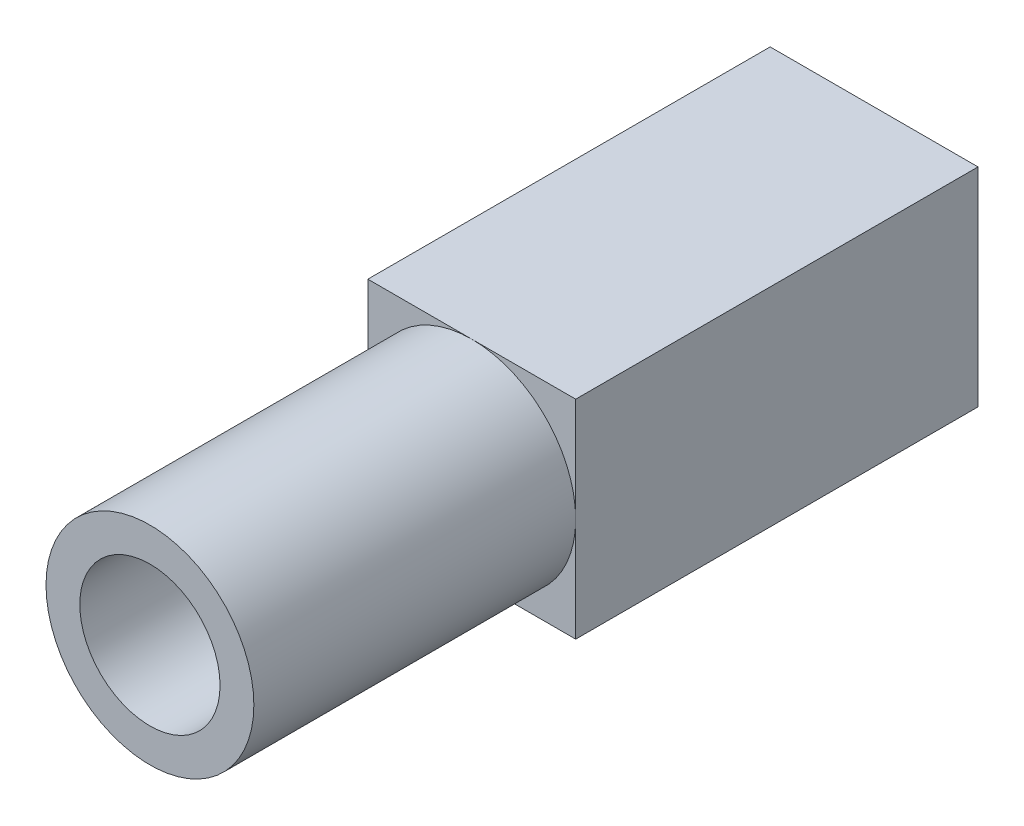
ISO-10303-21;
HEADER;
FILE_DESCRIPTION(('STEP AP214'),'2;1');
FILE_NAME('part.step','',(''),(''),'','','');
FILE_SCHEMA(('AUTOMOTIVE_DESIGN { 1 0 10303 214 1 1 1 1 }'));
ENDSEC;
DATA;
#1=APPLICATION_CONTEXT('core data for automotive mechanical design processes');
#2=APPLICATION_PROTOCOL_DEFINITION('international standard','automotive_design',2000,#1);
#3=PRODUCT_CONTEXT('',#1,'mechanical');
#4=PRODUCT('Part','Part','',(#3));
#5=PRODUCT_RELATED_PRODUCT_CATEGORY('part','',(#4));
#6=PRODUCT_DEFINITION_FORMATION('','',#4);
#7=PRODUCT_DEFINITION_CONTEXT('part definition',#1,'design');
#8=PRODUCT_DEFINITION('design','',#6,#7);
#9=PRODUCT_DEFINITION_SHAPE('','',#8);
#10=(LENGTH_UNIT() NAMED_UNIT(*) SI_UNIT(.MILLI.,.METRE.));
#11=(NAMED_UNIT(*) PLANE_ANGLE_UNIT() SI_UNIT($,.RADIAN.));
#12=(NAMED_UNIT(*) SI_UNIT($,.STERADIAN.) SOLID_ANGLE_UNIT());
#13=UNCERTAINTY_MEASURE_WITH_UNIT(LENGTH_MEASURE(1.E-05),#10,'distance_accuracy_value','');
#14=(GEOMETRIC_REPRESENTATION_CONTEXT(3) GLOBAL_UNCERTAINTY_ASSIGNED_CONTEXT((#13)) GLOBAL_UNIT_ASSIGNED_CONTEXT((#10,
#11,#12)) REPRESENTATION_CONTEXT('',''));
#15=CARTESIAN_POINT('',(0.,0.,0.));
#16=DIRECTION('',(0.,0.,1.));
#17=DIRECTION('',(1.,0.,0.));
#18=AXIS2_PLACEMENT_3D('',#15,#16,#17);
#19=CARTESIAN_POINT('',(0.,0.,22.));
#20=DIRECTION('',(0.,0.,-1.));
#21=DIRECTION('',(-1.,0.,0.));
#22=AXIS2_PLACEMENT_3D('',#19,#20,#21);
#23=CYLINDRICAL_SURFACE('',#22,3.875);
#24=CARTESIAN_POINT('',(0.,0.,22.));
#25=DIRECTION('',(0.,0.,1.));
#26=DIRECTION('',(1.,0.,0.));
#27=AXIS2_PLACEMENT_3D('',#24,#25,#26);
#28=CIRCLE('',#27,3.875);
#29=CARTESIAN_POINT('',(3.875,0.,22.));
#30=VERTEX_POINT('',#29);
#31=EDGE_CURVE('E12',#30,#30,#28,.T.);
#32=ORIENTED_EDGE('',*,*,#31,.F.);
#33=EDGE_LOOP('',(#32));
#34=FACE_BOUND('',#33,.T.);
#35=CARTESIAN_POINT('',(0.,0.,10.));
#36=DIRECTION('',(0.,0.,1.));
#37=DIRECTION('',(1.,0.,0.));
#38=AXIS2_PLACEMENT_3D('',#35,#36,#37);
#39=CIRCLE('',#38,3.875);
#40=CARTESIAN_POINT('',(-3.875,0.,10.));
#41=VERTEX_POINT('',#40);
#42=CARTESIAN_POINT('',(0.,-3.875,10.));
#43=VERTEX_POINT('',#42);
#44=EDGE_CURVE('E176',#41,#43,#39,.T.);
#45=ORIENTED_EDGE('',*,*,#44,.T.);
#46=CARTESIAN_POINT('',(0.,0.,10.));
#47=DIRECTION('',(0.,0.,1.));
#48=DIRECTION('',(1.,0.,0.));
#49=AXIS2_PLACEMENT_3D('',#46,#47,#48);
#50=CIRCLE('',#49,3.875);
#51=CARTESIAN_POINT('',(3.875,0.,10.));
#52=VERTEX_POINT('',#51);
#53=EDGE_CURVE('E163',#43,#52,#50,.T.);
#54=ORIENTED_EDGE('',*,*,#53,.T.);
#55=CARTESIAN_POINT('',(0.,0.,10.));
#56=DIRECTION('',(0.,0.,1.));
#57=DIRECTION('',(1.,0.,0.));
#58=AXIS2_PLACEMENT_3D('',#55,#56,#57);
#59=CIRCLE('',#58,3.875);
#60=CARTESIAN_POINT('',(0.,3.875,10.));
#61=VERTEX_POINT('',#60);
#62=EDGE_CURVE('E172',#52,#61,#59,.T.);
#63=ORIENTED_EDGE('',*,*,#62,.T.);
#64=CARTESIAN_POINT('',(0.,0.,10.));
#65=DIRECTION('',(0.,0.,1.));
#66=DIRECTION('',(1.,0.,0.));
#67=AXIS2_PLACEMENT_3D('',#64,#65,#66);
#68=CIRCLE('',#67,3.875);
#69=EDGE_CURVE('E181',#61,#41,#68,.T.);
#70=ORIENTED_EDGE('',*,*,#69,.T.);
#71=EDGE_LOOP('',(#45,#54,#63,#70));
#72=FACE_BOUND('',#71,.T.);
#73=ADVANCED_FACE('F80',(#34,#72),#23,.T.);
#74=CARTESIAN_POINT('',(0.,0.,22.));
#75=DIRECTION('',(0.,0.,1.));
#76=DIRECTION('',(1.,0.,0.));
#77=AXIS2_PLACEMENT_3D('',#74,#75,#76);
#78=PLANE('',#77);
#79=ORIENTED_EDGE('',*,*,#31,.T.);
#80=EDGE_LOOP('',(#79));
#81=FACE_BOUND('',#80,.T.);
#82=CARTESIAN_POINT('',(0.,0.,22.));
#83=DIRECTION('',(0.,0.,1.));
#84=DIRECTION('',(1.,0.,0.));
#85=AXIS2_PLACEMENT_3D('',#82,#83,#84);
#86=CIRCLE('',#85,2.615);
#87=CARTESIAN_POINT('',(2.615,0.,22.));
#88=VERTEX_POINT('',#87);
#89=EDGE_CURVE('E87',#88,#88,#86,.T.);
#90=ORIENTED_EDGE('',*,*,#89,.F.);
#91=EDGE_LOOP('',(#90));
#92=FACE_BOUND('',#91,.T.);
#93=ADVANCED_FACE('F203',(#81,#92),#78,.T.);
#94=CARTESIAN_POINT('',(0.,0.,22.));
#95=DIRECTION('',(0.,0.,-1.));
#96=DIRECTION('',(-1.,0.,0.));
#97=AXIS2_PLACEMENT_3D('',#94,#95,#96);
#98=CYLINDRICAL_SURFACE('',#97,2.615);
#99=ORIENTED_EDGE('',*,*,#89,.T.);
#100=EDGE_LOOP('',(#99));
#101=FACE_BOUND('',#100,.T.);
#102=CARTESIAN_POINT('',(0.,0.,0.));
#103=DIRECTION('',(0.,0.,1.));
#104=DIRECTION('',(1.,0.,0.));
#105=AXIS2_PLACEMENT_3D('',#102,#103,#104);
#106=CIRCLE('',#105,2.615);
#107=CARTESIAN_POINT('',(2.615,0.,0.));
#108=VERTEX_POINT('',#107);
#109=EDGE_CURVE('E193',#108,#108,#106,.T.);
#110=ORIENTED_EDGE('',*,*,#109,.F.);
#111=EDGE_LOOP('',(#110));
#112=FACE_BOUND('',#111,.T.);
#113=ADVANCED_FACE('F200',(#101,#112),#98,.F.);
#114=CARTESIAN_POINT('',(0.,0.,10.));
#115=DIRECTION('',(0.,0.,1.));
#116=DIRECTION('',(1.,0.,0.));
#117=AXIS2_PLACEMENT_3D('',#114,#115,#116);
#118=PLANE('',#117);
#119=ORIENTED_EDGE('',*,*,#69,.F.);
#120=DIRECTION('',(1.,0.,0.));
#121=VECTOR('',#120,1.);
#122=CARTESIAN_POINT('',(0.,3.875,10.));
#123=LINE('',#122,#121);
#124=CARTESIAN_POINT('',(-3.875,3.875,10.));
#125=VERTEX_POINT('',#124);
#126=EDGE_CURVE('E187',#125,#61,#123,.T.);
#127=ORIENTED_EDGE('',*,*,#126,.F.);
#128=DIRECTION('',(0.,-1.,0.));
#129=VECTOR('',#128,1.);
#130=CARTESIAN_POINT('',(-3.875,0.,10.));
#131=LINE('',#130,#129);
#132=EDGE_CURVE('E189',#125,#41,#131,.T.);
#133=ORIENTED_EDGE('',*,*,#132,.T.);
#134=EDGE_LOOP('',(#119,#127,#133));
#135=FACE_BOUND('',#134,.T.);
#136=ADVANCED_FACE('F202',(#135),#118,.T.);
#137=CARTESIAN_POINT('',(0.,3.875,-5.48007755419574));
#138=DIRECTION('',(0.,-1.,0.));
#139=DIRECTION('',(0.,0.,-1.));
#140=AXIS2_PLACEMENT_3D('',#137,#138,#139);
#141=PLANE('',#140);
#142=ORIENTED_EDGE('',*,*,#126,.T.);
#143=DIRECTION('',(1.,0.,0.));
#144=VECTOR('',#143,1.);
#145=CARTESIAN_POINT('',(0.,3.875,10.));
#146=LINE('',#145,#144);
#147=CARTESIAN_POINT('',(3.875,3.875,10.));
#148=VERTEX_POINT('',#147);
#149=EDGE_CURVE('E138',#61,#148,#146,.T.);
#150=ORIENTED_EDGE('',*,*,#149,.T.);
#151=DIRECTION('',(0.,0.,1.));
#152=VECTOR('',#151,1.);
#153=CARTESIAN_POINT('',(3.875,3.875,-5.48007755419574));
#154=LINE('',#153,#152);
#155=CARTESIAN_POINT('',(3.875,3.875,-5.));
#156=VERTEX_POINT('',#155);
#157=EDGE_CURVE('E132',#156,#148,#154,.T.);
#158=ORIENTED_EDGE('',*,*,#157,.F.);
#159=DIRECTION('',(1.,0.,0.));
#160=VECTOR('',#159,1.);
#161=CARTESIAN_POINT('',(-3.875,3.875,-5.));
#162=LINE('',#161,#160);
#163=CARTESIAN_POINT('',(-3.875,3.875,-5.));
#164=VERTEX_POINT('',#163);
#165=EDGE_CURVE('E136',#164,#156,#162,.T.);
#166=ORIENTED_EDGE('',*,*,#165,.F.);
#167=DIRECTION('',(0.,0.,1.));
#168=VECTOR('',#167,1.);
#169=CARTESIAN_POINT('',(-3.875,3.875,-5.48007755419574));
#170=LINE('',#169,#168);
#171=EDGE_CURVE('E102',#164,#125,#170,.T.);
#172=ORIENTED_EDGE('',*,*,#171,.T.);
#173=EDGE_LOOP('',(#142,#150,#158,#166,#172));
#174=FACE_BOUND('',#173,.T.);
#175=ADVANCED_FACE('F134',(#174),#141,.F.);
#176=CARTESIAN_POINT('',(-3.875,0.,-5.48007755419574));
#177=DIRECTION('',(-1.,0.,0.));
#178=DIRECTION('',(0.,-1.,0.));
#179=AXIS2_PLACEMENT_3D('',#176,#177,#178);
#180=PLANE('',#179);
#181=ORIENTED_EDGE('',*,*,#171,.F.);
#182=DIRECTION('',(0.,1.,0.));
#183=VECTOR('',#182,1.);
#184=CARTESIAN_POINT('',(-3.875,-3.875,-5.));
#185=LINE('',#184,#183);
#186=CARTESIAN_POINT('',(-3.875,-3.875,-5.));
#187=VERTEX_POINT('',#186);
#188=EDGE_CURVE('E158',#187,#164,#185,.T.);
#189=ORIENTED_EDGE('',*,*,#188,.F.);
#190=DIRECTION('',(0.,0.,1.));
#191=VECTOR('',#190,1.);
#192=CARTESIAN_POINT('',(-3.875,-3.875,-5.48007755419574));
#193=LINE('',#192,#191);
#194=CARTESIAN_POINT('',(-3.875,-3.875,10.));
#195=VERTEX_POINT('',#194);
#196=EDGE_CURVE('E177',#187,#195,#193,.T.);
#197=ORIENTED_EDGE('',*,*,#196,.T.);
#198=DIRECTION('',(0.,-1.,0.));
#199=VECTOR('',#198,1.);
#200=CARTESIAN_POINT('',(-3.875,0.,10.));
#201=LINE('',#200,#199);
#202=EDGE_CURVE('E94',#41,#195,#201,.T.);
#203=ORIENTED_EDGE('',*,*,#202,.F.);
#204=ORIENTED_EDGE('',*,*,#132,.F.);
#205=EDGE_LOOP('',(#181,#189,#197,#203,#204));
#206=FACE_BOUND('',#205,.T.);
#207=ADVANCED_FACE('F243',(#206),#180,.T.);
#208=CARTESIAN_POINT('',(0.,-3.875,-5.48007755419574));
#209=DIRECTION('',(0.,-1.,0.));
#210=DIRECTION('',(0.,0.,-1.));
#211=AXIS2_PLACEMENT_3D('',#208,#209,#210);
#212=PLANE('',#211);
#213=ORIENTED_EDGE('',*,*,#196,.F.);
#214=DIRECTION('',(-1.,0.,0.));
#215=VECTOR('',#214,1.);
#216=CARTESIAN_POINT('',(3.875,-3.875,-5.));
#217=LINE('',#216,#215);
#218=CARTESIAN_POINT('',(3.875,-3.875,-5.));
#219=VERTEX_POINT('',#218);
#220=EDGE_CURVE('E153',#219,#187,#217,.T.);
#221=ORIENTED_EDGE('',*,*,#220,.F.);
#222=DIRECTION('',(0.,0.,1.));
#223=VECTOR('',#222,1.);
#224=CARTESIAN_POINT('',(3.875,-3.875,-5.48007755419574));
#225=LINE('',#224,#223);
#226=CARTESIAN_POINT('',(3.875,-3.875,10.));
#227=VERTEX_POINT('',#226);
#228=EDGE_CURVE('E149',#219,#227,#225,.T.);
#229=ORIENTED_EDGE('',*,*,#228,.T.);
#230=DIRECTION('',(1.,0.,0.));
#231=VECTOR('',#230,1.);
#232=CARTESIAN_POINT('',(0.,-3.875,10.));
#233=LINE('',#232,#231);
#234=EDGE_CURVE('E143',#43,#227,#233,.T.);
#235=ORIENTED_EDGE('',*,*,#234,.F.);
#236=DIRECTION('',(1.,0.,0.));
#237=VECTOR('',#236,1.);
#238=CARTESIAN_POINT('',(0.,-3.875,10.));
#239=LINE('',#238,#237);
#240=EDGE_CURVE('E179',#195,#43,#239,.T.);
#241=ORIENTED_EDGE('',*,*,#240,.F.);
#242=EDGE_LOOP('',(#213,#221,#229,#235,#241));
#243=FACE_BOUND('',#242,.T.);
#244=ADVANCED_FACE('F228',(#243),#212,.T.);
#245=CARTESIAN_POINT('',(0.,0.,10.));
#246=DIRECTION('',(0.,0.,1.));
#247=DIRECTION('',(1.,0.,0.));
#248=AXIS2_PLACEMENT_3D('',#245,#246,#247);
#249=PLANE('',#248);
#250=ORIENTED_EDGE('',*,*,#44,.F.);
#251=ORIENTED_EDGE('',*,*,#202,.T.);
#252=ORIENTED_EDGE('',*,*,#240,.T.);
#253=EDGE_LOOP('',(#250,#251,#252));
#254=FACE_BOUND('',#253,.T.);
#255=ADVANCED_FACE('F232',(#254),#249,.T.);
#256=CARTESIAN_POINT('',(0.,0.,10.));
#257=DIRECTION('',(0.,0.,1.));
#258=DIRECTION('',(1.,0.,0.));
#259=AXIS2_PLACEMENT_3D('',#256,#257,#258);
#260=PLANE('',#259);
#261=ORIENTED_EDGE('',*,*,#62,.F.);
#262=DIRECTION('',(0.,-1.,0.));
#263=VECTOR('',#262,1.);
#264=CARTESIAN_POINT('',(3.875,0.,10.));
#265=LINE('',#264,#263);
#266=EDGE_CURVE('E142',#148,#52,#265,.T.);
#267=ORIENTED_EDGE('',*,*,#266,.F.);
#268=ORIENTED_EDGE('',*,*,#149,.F.);
#269=EDGE_LOOP('',(#261,#267,#268));
#270=FACE_BOUND('',#269,.T.);
#271=ADVANCED_FACE('F230',(#270),#260,.T.);
#272=CARTESIAN_POINT('',(3.875,0.,-5.48007755419574));
#273=DIRECTION('',(-1.,0.,0.));
#274=DIRECTION('',(0.,0.,1.));
#275=AXIS2_PLACEMENT_3D('',#272,#273,#274);
#276=PLANE('',#275);
#277=ORIENTED_EDGE('',*,*,#266,.T.);
#278=DIRECTION('',(0.,-1.,0.));
#279=VECTOR('',#278,1.);
#280=CARTESIAN_POINT('',(3.875,0.,10.));
#281=LINE('',#280,#279);
#282=EDGE_CURVE('E166',#52,#227,#281,.T.);
#283=ORIENTED_EDGE('',*,*,#282,.T.);
#284=ORIENTED_EDGE('',*,*,#228,.F.);
#285=DIRECTION('',(0.,-1.,0.));
#286=VECTOR('',#285,1.);
#287=CARTESIAN_POINT('',(3.875,3.875,-5.));
#288=LINE('',#287,#286);
#289=EDGE_CURVE('E146',#156,#219,#288,.T.);
#290=ORIENTED_EDGE('',*,*,#289,.F.);
#291=ORIENTED_EDGE('',*,*,#157,.T.);
#292=EDGE_LOOP('',(#277,#283,#284,#290,#291));
#293=FACE_BOUND('',#292,.T.);
#294=ADVANCED_FACE('F147',(#293),#276,.F.);
#295=CARTESIAN_POINT('',(0.,0.,10.));
#296=DIRECTION('',(0.,0.,1.));
#297=DIRECTION('',(1.,0.,0.));
#298=AXIS2_PLACEMENT_3D('',#295,#296,#297);
#299=PLANE('',#298);
#300=ORIENTED_EDGE('',*,*,#53,.F.);
#301=ORIENTED_EDGE('',*,*,#234,.T.);
#302=ORIENTED_EDGE('',*,*,#282,.F.);
#303=EDGE_LOOP('',(#300,#301,#302));
#304=FACE_BOUND('',#303,.T.);
#305=ADVANCED_FACE('F225',(#304),#299,.T.);
#306=CARTESIAN_POINT('',(0.,0.,0.));
#307=DIRECTION('',(0.,0.,-1.));
#308=DIRECTION('',(-1.,0.,0.));
#309=AXIS2_PLACEMENT_3D('',#306,#307,#308);
#310=PLANE('',#309);
#311=ORIENTED_EDGE('',*,*,#109,.T.);
#312=EDGE_LOOP('',(#311));
#313=FACE_BOUND('',#312,.T.);
#314=ADVANCED_FACE('F198',(#313),#310,.F.);
#315=CARTESIAN_POINT('',(0.,0.,-5.));
#316=DIRECTION('',(0.,0.,-1.));
#317=DIRECTION('',(-1.,0.,0.));
#318=AXIS2_PLACEMENT_3D('',#315,#316,#317);
#319=PLANE('',#318);
#320=ORIENTED_EDGE('',*,*,#165,.T.);
#321=ORIENTED_EDGE('',*,*,#289,.T.);
#322=ORIENTED_EDGE('',*,*,#220,.T.);
#323=ORIENTED_EDGE('',*,*,#188,.T.);
#324=EDGE_LOOP('',(#320,#321,#322,#323));
#325=FACE_BOUND('',#324,.T.);
#326=ADVANCED_FACE('F156',(#325),#319,.T.);
#327=CLOSED_SHELL('',(#73,#93,#113,#136,#175,#207,#244,#255,#271,#294,#305,#314,#326));
#328=MANIFOLD_SOLID_BREP('B2',#327);
#329=ADVANCED_BREP_SHAPE_REPRESENTATION('',(#18,#328),#14);
#330=SHAPE_DEFINITION_REPRESENTATION(#9,#329);
ENDSEC;
END-ISO-10303-21;
